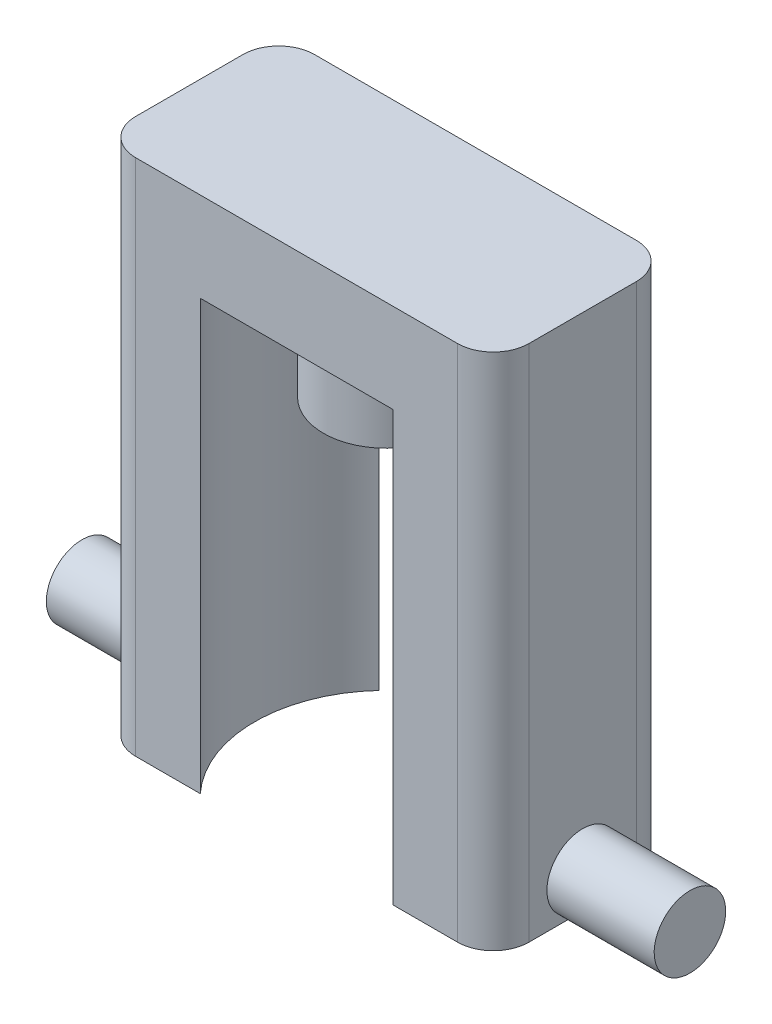
ISO-10303-21;
HEADER;
FILE_DESCRIPTION(('STEP AP214'),'2;1');
FILE_NAME('part.step','',(''),(''),'','','');
FILE_SCHEMA(('AUTOMOTIVE_DESIGN { 1 0 10303 214 1 1 1 1 }'));
ENDSEC;
DATA;
#1=APPLICATION_CONTEXT('core data for automotive mechanical design processes');
#2=APPLICATION_PROTOCOL_DEFINITION('international standard','automotive_design',2000,#1);
#3=PRODUCT_CONTEXT('',#1,'mechanical');
#4=PRODUCT('Part','Part','',(#3));
#5=PRODUCT_RELATED_PRODUCT_CATEGORY('part','',(#4));
#6=PRODUCT_DEFINITION_FORMATION('','',#4);
#7=PRODUCT_DEFINITION_CONTEXT('part definition',#1,'design');
#8=PRODUCT_DEFINITION('design','',#6,#7);
#9=PRODUCT_DEFINITION_SHAPE('','',#8);
#10=(LENGTH_UNIT() NAMED_UNIT(*) SI_UNIT(.MILLI.,.METRE.));
#11=(NAMED_UNIT(*) PLANE_ANGLE_UNIT() SI_UNIT($,.RADIAN.));
#12=(NAMED_UNIT(*) SI_UNIT($,.STERADIAN.) SOLID_ANGLE_UNIT());
#13=UNCERTAINTY_MEASURE_WITH_UNIT(LENGTH_MEASURE(1.E-05),#10,'distance_accuracy_value','');
#14=(GEOMETRIC_REPRESENTATION_CONTEXT(3) GLOBAL_UNCERTAINTY_ASSIGNED_CONTEXT((#13)) GLOBAL_UNIT_ASSIGNED_CONTEXT((#10,
#11,#12)) REPRESENTATION_CONTEXT('',''));
#15=CARTESIAN_POINT('',(0.,0.,0.));
#16=DIRECTION('',(0.,0.,1.));
#17=DIRECTION('',(1.,0.,0.));
#18=AXIS2_PLACEMENT_3D('',#15,#16,#17);
#19=CARTESIAN_POINT('',(0.,0.,0.));
#20=DIRECTION('',(0.,1.,0.));
#21=DIRECTION('',(0.,0.,1.));
#22=AXIS2_PLACEMENT_3D('',#19,#20,#21);
#23=PLANE('',#22);
#24=CARTESIAN_POINT('',(0.,0.,0.));
#25=DIRECTION('',(0.,-1.,0.));
#26=DIRECTION('',(0.,0.,-1.));
#27=AXIS2_PLACEMENT_3D('',#24,#25,#26);
#28=CIRCLE('',#27,4.445);
#29=CARTESIAN_POINT('',(0.,0.,-4.445));
#30=VERTEX_POINT('',#29);
#31=EDGE_CURVE('E197',#30,#30,#28,.T.);
#32=ORIENTED_EDGE('',*,*,#31,.F.);
#33=EDGE_LOOP('',(#32));
#34=FACE_BOUND('',#33,.T.);
#35=CARTESIAN_POINT('',(0.,0.,0.));
#36=DIRECTION('',(0.,1.,0.));
#37=DIRECTION('',(0.,0.,1.));
#38=AXIS2_PLACEMENT_3D('',#35,#36,#37);
#39=CIRCLE('',#38,9.3345);
#40=CARTESIAN_POINT('',(6.84181191279036,0.,6.34999999999999));
#41=VERTEX_POINT('',#40);
#42=CARTESIAN_POINT('',(6.84181191279036,0.,-6.35));
#43=VERTEX_POINT('',#42);
#44=EDGE_CURVE('E157',#41,#43,#39,.T.);
#45=ORIENTED_EDGE('',*,*,#44,.F.);
#46=DIRECTION('',(1.,0.,0.));
#47=VECTOR('',#46,1.);
#48=CARTESIAN_POINT('',(-13.97,0.,6.35));
#49=LINE('',#48,#47);
#50=CARTESIAN_POINT('',(-6.84181191279036,0.,6.35));
#51=VERTEX_POINT('',#50);
#52=EDGE_CURVE('E196',#51,#41,#49,.T.);
#53=ORIENTED_EDGE('',*,*,#52,.F.);
#54=CARTESIAN_POINT('',(0.,0.,0.));
#55=DIRECTION('',(0.,1.,0.));
#56=DIRECTION('',(0.,0.,-1.));
#57=AXIS2_PLACEMENT_3D('',#54,#55,#56);
#58=CIRCLE('',#57,9.3345);
#59=CARTESIAN_POINT('',(-6.84181191279035,0.,-6.35));
#60=VERTEX_POINT('',#59);
#61=EDGE_CURVE('E167',#60,#51,#58,.T.);
#62=ORIENTED_EDGE('',*,*,#61,.F.);
#63=DIRECTION('',(-1.,0.,0.));
#64=VECTOR('',#63,1.);
#65=CARTESIAN_POINT('',(-13.97,0.,-6.35));
#66=LINE('',#65,#64);
#67=EDGE_CURVE('E208',#43,#60,#66,.T.);
#68=ORIENTED_EDGE('',*,*,#67,.F.);
#69=EDGE_LOOP('',(#45,#53,#62,#68));
#70=FACE_BOUND('',#69,.T.);
#71=ADVANCED_FACE('F39',(#34,#70),#23,.F.);
#72=CARTESIAN_POINT('',(-13.97,6.35,-6.35));
#73=DIRECTION('',(1.,0.,0.));
#74=DIRECTION('',(0.,0.,-1.));
#75=AXIS2_PLACEMENT_3D('',#72,#73,#74);
#76=PLANE('',#75);
#77=DIRECTION('',(0.,0.,1.));
#78=VECTOR('',#77,1.);
#79=CARTESIAN_POINT('',(-13.97,6.35,-6.35));
#80=LINE('',#79,#78);
#81=CARTESIAN_POINT('',(-13.97,6.35,-3.81));
#82=VERTEX_POINT('',#81);
#83=CARTESIAN_POINT('',(-13.97,6.35,3.81));
#84=VERTEX_POINT('',#83);
#85=EDGE_CURVE('E203',#82,#84,#80,.T.);
#86=ORIENTED_EDGE('',*,*,#85,.F.);
#87=DIRECTION('',(0.,-1.,0.));
#88=VECTOR('',#87,1.);
#89=CARTESIAN_POINT('',(-13.97,6.35,-3.81));
#90=LINE('',#89,#88);
#91=CARTESIAN_POINT('',(-13.97,-30.48,-3.81));
#92=VERTEX_POINT('',#91);
#93=EDGE_CURVE('E226',#82,#92,#90,.T.);
#94=ORIENTED_EDGE('',*,*,#93,.T.);
#95=DIRECTION('',(0.,0.,-1.));
#96=VECTOR('',#95,1.);
#97=CARTESIAN_POINT('',(-13.97,-30.48,-6.35));
#98=LINE('',#97,#96);
#99=CARTESIAN_POINT('',(-13.97,-30.48,0.));
#100=VERTEX_POINT('',#99);
#101=EDGE_CURVE('E178',#100,#92,#98,.T.);
#102=ORIENTED_EDGE('',*,*,#101,.F.);
#103=CARTESIAN_POINT('',(-13.97,-27.94,0.));
#104=DIRECTION('',(-1.,0.,0.));
#105=DIRECTION('',(0.,0.,1.));
#106=AXIS2_PLACEMENT_3D('',#103,#104,#105);
#107=CIRCLE('',#106,2.54);
#108=EDGE_CURVE('E278',#100,#100,#107,.T.);
#109=ORIENTED_EDGE('',*,*,#108,.F.);
#110=CARTESIAN_POINT('',(-13.97,-30.48,3.81));
#111=VERTEX_POINT('',#110);
#112=EDGE_CURVE('E179',#111,#100,#98,.T.);
#113=ORIENTED_EDGE('',*,*,#112,.F.);
#114=DIRECTION('',(0.,-1.,0.));
#115=VECTOR('',#114,1.);
#116=CARTESIAN_POINT('',(-13.97,6.35,3.81));
#117=LINE('',#116,#115);
#118=EDGE_CURVE('E201',#111,#84,#117,.F.);
#119=ORIENTED_EDGE('',*,*,#118,.T.);
#120=EDGE_LOOP('',(#86,#94,#102,#109,#113,#119));
#121=FACE_BOUND('',#120,.T.);
#122=ADVANCED_FACE('F276',(#121),#76,.F.);
#123=CARTESIAN_POINT('',(-13.97,6.35,6.35));
#124=DIRECTION('',(0.,0.,-1.));
#125=DIRECTION('',(-1.,0.,0.));
#126=AXIS2_PLACEMENT_3D('',#123,#124,#125);
#127=PLANE('',#126);
#128=DIRECTION('',(1.,0.,0.));
#129=VECTOR('',#128,1.);
#130=CARTESIAN_POINT('',(-13.97,6.35,6.35));
#131=LINE('',#130,#129);
#132=CARTESIAN_POINT('',(-11.43,6.35,6.35));
#133=VERTEX_POINT('',#132);
#134=CARTESIAN_POINT('',(11.43,6.35,6.35));
#135=VERTEX_POINT('',#134);
#136=EDGE_CURVE('E207',#133,#135,#131,.T.);
#137=ORIENTED_EDGE('',*,*,#136,.F.);
#138=DIRECTION('',(0.,-1.,0.));
#139=VECTOR('',#138,1.);
#140=CARTESIAN_POINT('',(-11.43,6.35,6.35));
#141=LINE('',#140,#139);
#142=CARTESIAN_POINT('',(-11.43,-30.48,6.35));
#143=VERTEX_POINT('',#142);
#144=EDGE_CURVE('E258',#133,#143,#141,.T.);
#145=ORIENTED_EDGE('',*,*,#144,.T.);
#146=DIRECTION('',(-1.,0.,0.));
#147=VECTOR('',#146,1.);
#148=CARTESIAN_POINT('',(-13.97,-30.48,6.35));
#149=LINE('',#148,#147);
#150=CARTESIAN_POINT('',(-6.84181191279036,-30.48,6.35));
#151=VERTEX_POINT('',#150);
#152=EDGE_CURVE('E174',#151,#143,#149,.T.);
#153=ORIENTED_EDGE('',*,*,#152,.F.);
#154=DIRECTION('',(0.,1.,0.));
#155=VECTOR('',#154,1.);
#156=CARTESIAN_POINT('',(-6.84181191279036,-30.48,6.35));
#157=LINE('',#156,#155);
#158=EDGE_CURVE('E182',#151,#51,#157,.T.);
#159=ORIENTED_EDGE('',*,*,#158,.T.);
#160=ORIENTED_EDGE('',*,*,#52,.T.);
#161=DIRECTION('',(0.,1.,0.));
#162=VECTOR('',#161,1.);
#163=CARTESIAN_POINT('',(6.84181191279036,-30.48,6.34999999999999));
#164=LINE('',#163,#162);
#165=CARTESIAN_POINT('',(6.84181191279036,-30.48,6.34999999999999));
#166=VERTEX_POINT('',#165);
#167=EDGE_CURVE('E156',#166,#41,#164,.T.);
#168=ORIENTED_EDGE('',*,*,#167,.F.);
#169=DIRECTION('',(-1.,0.,0.));
#170=VECTOR('',#169,1.);
#171=CARTESIAN_POINT('',(13.97,-30.48,6.34999999999999));
#172=LINE('',#171,#170);
#173=CARTESIAN_POINT('',(11.43,-30.48,6.34999999999999));
#174=VERTEX_POINT('',#173);
#175=EDGE_CURVE('E141',#174,#166,#172,.T.);
#176=ORIENTED_EDGE('',*,*,#175,.F.);
#177=DIRECTION('',(0.,-1.,0.));
#178=VECTOR('',#177,1.);
#179=CARTESIAN_POINT('',(11.43,6.35,6.35));
#180=LINE('',#179,#178);
#181=EDGE_CURVE('E255',#174,#135,#180,.F.);
#182=ORIENTED_EDGE('',*,*,#181,.T.);
#183=EDGE_LOOP('',(#137,#145,#153,#159,#160,#168,#176,#182));
#184=FACE_BOUND('',#183,.T.);
#185=ADVANCED_FACE('F314',(#184),#127,.F.);
#186=CARTESIAN_POINT('',(13.97,6.35,-6.35));
#187=DIRECTION('',(-1.,0.,0.));
#188=DIRECTION('',(0.,0.,1.));
#189=AXIS2_PLACEMENT_3D('',#186,#187,#188);
#190=PLANE('',#189);
#191=DIRECTION('',(0.,0.,1.));
#192=VECTOR('',#191,1.);
#193=CARTESIAN_POINT('',(13.97,-30.48,-6.35000000000001));
#194=LINE('',#193,#192);
#195=CARTESIAN_POINT('',(13.97,-30.48,-3.81));
#196=VERTEX_POINT('',#195);
#197=CARTESIAN_POINT('',(13.97,-30.48,0.));
#198=VERTEX_POINT('',#197);
#199=EDGE_CURVE('E133',#196,#198,#194,.T.);
#200=ORIENTED_EDGE('',*,*,#199,.F.);
#201=DIRECTION('',(0.,-1.,0.));
#202=VECTOR('',#201,1.);
#203=CARTESIAN_POINT('',(13.97,6.35,-3.81));
#204=LINE('',#203,#202);
#205=CARTESIAN_POINT('',(13.97,6.35,-3.81));
#206=VERTEX_POINT('',#205);
#207=EDGE_CURVE('E11',#196,#206,#204,.F.);
#208=ORIENTED_EDGE('',*,*,#207,.T.);
#209=DIRECTION('',(0.,0.,-1.));
#210=VECTOR('',#209,1.);
#211=CARTESIAN_POINT('',(13.97,6.35,-6.35));
#212=LINE('',#211,#210);
#213=CARTESIAN_POINT('',(13.97,6.35,3.81));
#214=VERTEX_POINT('',#213);
#215=EDGE_CURVE('E212',#214,#206,#212,.T.);
#216=ORIENTED_EDGE('',*,*,#215,.F.);
#217=DIRECTION('',(0.,-1.,0.));
#218=VECTOR('',#217,1.);
#219=CARTESIAN_POINT('',(13.97,6.35,3.81));
#220=LINE('',#219,#218);
#221=CARTESIAN_POINT('',(13.97,-30.48,3.80999999999999));
#222=VERTEX_POINT('',#221);
#223=EDGE_CURVE('E48',#214,#222,#220,.T.);
#224=ORIENTED_EDGE('',*,*,#223,.T.);
#225=EDGE_CURVE('E136',#198,#222,#194,.T.);
#226=ORIENTED_EDGE('',*,*,#225,.F.);
#227=CARTESIAN_POINT('',(13.97,-27.94,0.));
#228=DIRECTION('',(1.,0.,0.));
#229=DIRECTION('',(0.,0.,-1.));
#230=AXIS2_PLACEMENT_3D('',#227,#228,#229);
#231=CIRCLE('',#230,2.54);
#232=EDGE_CURVE('E145',#198,#198,#231,.T.);
#233=ORIENTED_EDGE('',*,*,#232,.F.);
#234=EDGE_LOOP('',(#200,#208,#216,#224,#226,#233));
#235=FACE_BOUND('',#234,.T.);
#236=ADVANCED_FACE('F143',(#235),#190,.F.);
#237=CARTESIAN_POINT('',(-13.97,6.35,-6.35));
#238=DIRECTION('',(0.,0.,1.));
#239=DIRECTION('',(1.,0.,0.));
#240=AXIS2_PLACEMENT_3D('',#237,#238,#239);
#241=PLANE('',#240);
#242=DIRECTION('',(1.,0.,0.));
#243=VECTOR('',#242,1.);
#244=CARTESIAN_POINT('',(-6.84181191279035,-30.48,-6.35));
#245=LINE('',#244,#243);
#246=CARTESIAN_POINT('',(-11.43,-30.48,-6.35));
#247=VERTEX_POINT('',#246);
#248=CARTESIAN_POINT('',(-6.84181191279035,-30.48,-6.35));
#249=VERTEX_POINT('',#248);
#250=EDGE_CURVE('E168',#247,#249,#245,.T.);
#251=ORIENTED_EDGE('',*,*,#250,.F.);
#252=DIRECTION('',(0.,-1.,0.));
#253=VECTOR('',#252,1.);
#254=CARTESIAN_POINT('',(-11.43,6.35,-6.35));
#255=LINE('',#254,#253);
#256=CARTESIAN_POINT('',(-11.43,6.35,-6.35));
#257=VERTEX_POINT('',#256);
#258=EDGE_CURVE('E240',#247,#257,#255,.F.);
#259=ORIENTED_EDGE('',*,*,#258,.T.);
#260=DIRECTION('',(-1.,0.,0.));
#261=VECTOR('',#260,1.);
#262=CARTESIAN_POINT('',(-13.97,6.35,-6.35));
#263=LINE('',#262,#261);
#264=CARTESIAN_POINT('',(11.43,6.35,-6.35));
#265=VERTEX_POINT('',#264);
#266=EDGE_CURVE('E202',#265,#257,#263,.T.);
#267=ORIENTED_EDGE('',*,*,#266,.F.);
#268=DIRECTION('',(0.,-1.,0.));
#269=VECTOR('',#268,1.);
#270=CARTESIAN_POINT('',(11.43,6.35,-6.35));
#271=LINE('',#270,#269);
#272=CARTESIAN_POINT('',(11.43,-30.48,-6.35000000000001));
#273=VERTEX_POINT('',#272);
#274=EDGE_CURVE('E236',#265,#273,#271,.T.);
#275=ORIENTED_EDGE('',*,*,#274,.T.);
#276=DIRECTION('',(1.,0.,0.));
#277=VECTOR('',#276,1.);
#278=CARTESIAN_POINT('',(6.84181191279035,-30.48,-6.35000000000001));
#279=LINE('',#278,#277);
#280=CARTESIAN_POINT('',(6.84181191279035,-30.48,-6.35000000000001));
#281=VERTEX_POINT('',#280);
#282=EDGE_CURVE('E148',#281,#273,#279,.T.);
#283=ORIENTED_EDGE('',*,*,#282,.F.);
#284=DIRECTION('',(0.,1.,0.));
#285=VECTOR('',#284,1.);
#286=CARTESIAN_POINT('',(6.84181191279035,-30.48,-6.35000000000001));
#287=LINE('',#286,#285);
#288=EDGE_CURVE('E163',#281,#43,#287,.T.);
#289=ORIENTED_EDGE('',*,*,#288,.T.);
#290=ORIENTED_EDGE('',*,*,#67,.T.);
#291=DIRECTION('',(0.,1.,0.));
#292=VECTOR('',#291,1.);
#293=CARTESIAN_POINT('',(-6.84181191279035,-30.48,-6.35));
#294=LINE('',#293,#292);
#295=EDGE_CURVE('E188',#249,#60,#294,.T.);
#296=ORIENTED_EDGE('',*,*,#295,.F.);
#297=EDGE_LOOP('',(#251,#259,#267,#275,#283,#289,#290,#296));
#298=FACE_BOUND('',#297,.T.);
#299=ADVANCED_FACE('F286',(#298),#241,.F.);
#300=CARTESIAN_POINT('',(0.,6.35,0.));
#301=DIRECTION('',(0.,1.,0.));
#302=DIRECTION('',(0.,0.,1.));
#303=AXIS2_PLACEMENT_3D('',#300,#301,#302);
#304=PLANE('',#303);
#305=ORIENTED_EDGE('',*,*,#266,.T.);
#306=CARTESIAN_POINT('',(-11.43,6.35,-3.81));
#307=DIRECTION('',(0.,1.,0.));
#308=DIRECTION('',(0.,0.,1.));
#309=AXIS2_PLACEMENT_3D('',#306,#307,#308);
#310=CIRCLE('',#309,2.54);
#311=EDGE_CURVE('E252',#257,#82,#310,.T.);
#312=ORIENTED_EDGE('',*,*,#311,.T.);
#313=ORIENTED_EDGE('',*,*,#85,.T.);
#314=CARTESIAN_POINT('',(-11.43,6.35,3.81));
#315=DIRECTION('',(0.,1.,0.));
#316=DIRECTION('',(0.,0.,1.));
#317=AXIS2_PLACEMENT_3D('',#314,#315,#316);
#318=CIRCLE('',#317,2.54);
#319=EDGE_CURVE('E249',#84,#133,#318,.T.);
#320=ORIENTED_EDGE('',*,*,#319,.T.);
#321=ORIENTED_EDGE('',*,*,#136,.T.);
#322=CARTESIAN_POINT('',(11.43,6.35,3.81));
#323=DIRECTION('',(0.,1.,0.));
#324=DIRECTION('',(0.,0.,1.));
#325=AXIS2_PLACEMENT_3D('',#322,#323,#324);
#326=CIRCLE('',#325,2.54);
#327=EDGE_CURVE('E243',#135,#214,#326,.T.);
#328=ORIENTED_EDGE('',*,*,#327,.T.);
#329=ORIENTED_EDGE('',*,*,#215,.T.);
#330=CARTESIAN_POINT('',(11.43,6.35,-3.81));
#331=DIRECTION('',(0.,1.,0.));
#332=DIRECTION('',(0.,0.,1.));
#333=AXIS2_PLACEMENT_3D('',#330,#331,#332);
#334=CIRCLE('',#333,2.54);
#335=EDGE_CURVE('E246',#206,#265,#334,.T.);
#336=ORIENTED_EDGE('',*,*,#335,.T.);
#337=EDGE_LOOP('',(#305,#312,#313,#320,#321,#328,#329,#336));
#338=FACE_BOUND('',#337,.T.);
#339=ADVANCED_FACE('F290',(#338),#304,.T.);
#340=CARTESIAN_POINT('',(0.,-5.842,0.));
#341=DIRECTION('',(0.,1.,0.));
#342=DIRECTION('',(0.,0.,1.));
#343=AXIS2_PLACEMENT_3D('',#340,#341,#342);
#344=CYLINDRICAL_SURFACE('',#343,4.445);
#345=CARTESIAN_POINT('',(0.,-5.842,0.));
#346=DIRECTION('',(0.,-1.,0.));
#347=DIRECTION('',(0.,0.,-1.));
#348=AXIS2_PLACEMENT_3D('',#345,#346,#347);
#349=CIRCLE('',#348,4.445);
#350=CARTESIAN_POINT('',(0.,-5.842,-4.445));
#351=VERTEX_POINT('',#350);
#352=EDGE_CURVE('E192',#351,#351,#349,.T.);
#353=ORIENTED_EDGE('',*,*,#352,.F.);
#354=EDGE_LOOP('',(#353));
#355=FACE_BOUND('',#354,.T.);
#356=ORIENTED_EDGE('',*,*,#31,.T.);
#357=EDGE_LOOP('',(#356));
#358=FACE_BOUND('',#357,.T.);
#359=ADVANCED_FACE('F451',(#355,#358),#344,.T.);
#360=CARTESIAN_POINT('',(0.,-5.842,0.));
#361=DIRECTION('',(0.,-1.,0.));
#362=DIRECTION('',(0.,0.,-1.));
#363=AXIS2_PLACEMENT_3D('',#360,#361,#362);
#364=PLANE('',#363);
#365=ORIENTED_EDGE('',*,*,#352,.T.);
#366=EDGE_LOOP('',(#365));
#367=FACE_BOUND('',#366,.T.);
#368=ADVANCED_FACE('F432',(#367),#364,.T.);
#369=CARTESIAN_POINT('',(0.,-30.48,0.));
#370=DIRECTION('',(0.,1.,0.));
#371=DIRECTION('',(0.,0.,1.));
#372=AXIS2_PLACEMENT_3D('',#369,#370,#371);
#373=CYLINDRICAL_SURFACE('',#372,9.3345);
#374=ORIENTED_EDGE('',*,*,#61,.T.);
#375=ORIENTED_EDGE('',*,*,#158,.F.);
#376=CARTESIAN_POINT('',(0.,-30.48,0.));
#377=DIRECTION('',(0.,1.,0.));
#378=DIRECTION('',(0.,0.,-1.));
#379=AXIS2_PLACEMENT_3D('',#376,#377,#378);
#380=CIRCLE('',#379,9.3345);
#381=EDGE_CURVE('E171',#249,#151,#380,.T.);
#382=ORIENTED_EDGE('',*,*,#381,.F.);
#383=ORIENTED_EDGE('',*,*,#295,.T.);
#384=EDGE_LOOP('',(#374,#375,#382,#383));
#385=FACE_BOUND('',#384,.T.);
#386=ADVANCED_FACE('F309',(#385),#373,.F.);
#387=CARTESIAN_POINT('',(0.,-30.48,0.));
#388=DIRECTION('',(0.,-1.,0.));
#389=DIRECTION('',(0.,0.,-1.));
#390=AXIS2_PLACEMENT_3D('',#387,#388,#389);
#391=PLANE('',#390);
#392=ORIENTED_EDGE('',*,*,#101,.T.);
#393=CARTESIAN_POINT('',(-11.43,-30.48,-3.81));
#394=DIRECTION('',(0.,-1.,0.));
#395=DIRECTION('',(0.,0.,-1.));
#396=AXIS2_PLACEMENT_3D('',#393,#394,#395);
#397=CIRCLE('',#396,2.54);
#398=EDGE_CURVE('E233',#92,#247,#397,.T.);
#399=ORIENTED_EDGE('',*,*,#398,.T.);
#400=ORIENTED_EDGE('',*,*,#250,.T.);
#401=ORIENTED_EDGE('',*,*,#381,.T.);
#402=ORIENTED_EDGE('',*,*,#152,.T.);
#403=CARTESIAN_POINT('',(-11.43,-30.48,3.81));
#404=DIRECTION('',(0.,-1.,0.));
#405=DIRECTION('',(0.,0.,-1.));
#406=AXIS2_PLACEMENT_3D('',#403,#404,#405);
#407=CIRCLE('',#406,2.54);
#408=EDGE_CURVE('E230',#143,#111,#407,.T.);
#409=ORIENTED_EDGE('',*,*,#408,.T.);
#410=ORIENTED_EDGE('',*,*,#112,.T.);
#411=EDGE_LOOP('',(#392,#399,#400,#401,#402,#409,#410));
#412=FACE_BOUND('',#411,.T.);
#413=ADVANCED_FACE('F270',(#412),#391,.T.);
#414=CARTESIAN_POINT('',(0.,-30.48,0.));
#415=DIRECTION('',(0.,1.,0.));
#416=DIRECTION('',(0.,0.,1.));
#417=AXIS2_PLACEMENT_3D('',#414,#415,#416);
#418=CYLINDRICAL_SURFACE('',#417,9.3345);
#419=ORIENTED_EDGE('',*,*,#44,.T.);
#420=ORIENTED_EDGE('',*,*,#288,.F.);
#421=CARTESIAN_POINT('',(0.,-30.48,0.));
#422=DIRECTION('',(0.,1.,0.));
#423=DIRECTION('',(0.,0.,1.));
#424=AXIS2_PLACEMENT_3D('',#421,#422,#423);
#425=CIRCLE('',#424,9.3345);
#426=EDGE_CURVE('E150',#166,#281,#425,.T.);
#427=ORIENTED_EDGE('',*,*,#426,.F.);
#428=ORIENTED_EDGE('',*,*,#167,.T.);
#429=EDGE_LOOP('',(#419,#420,#427,#428));
#430=FACE_BOUND('',#429,.T.);
#431=ADVANCED_FACE('F301',(#430),#418,.F.);
#432=CARTESIAN_POINT('',(0.,-30.48,0.));
#433=DIRECTION('',(0.,1.,0.));
#434=DIRECTION('',(0.,0.,1.));
#435=AXIS2_PLACEMENT_3D('',#432,#433,#434);
#436=PLANE('',#435);
#437=ORIENTED_EDGE('',*,*,#282,.T.);
#438=CARTESIAN_POINT('',(11.43,-30.48,-3.81));
#439=DIRECTION('',(0.,1.,0.));
#440=DIRECTION('',(0.,0.,1.));
#441=AXIS2_PLACEMENT_3D('',#438,#439,#440);
#442=CIRCLE('',#441,2.54);
#443=EDGE_CURVE('E63',#273,#196,#442,.F.);
#444=ORIENTED_EDGE('',*,*,#443,.T.);
#445=ORIENTED_EDGE('',*,*,#199,.T.);
#446=ORIENTED_EDGE('',*,*,#225,.T.);
#447=CARTESIAN_POINT('',(11.43,-30.48,3.81));
#448=DIRECTION('',(0.,1.,0.));
#449=DIRECTION('',(0.,0.,1.));
#450=AXIS2_PLACEMENT_3D('',#447,#448,#449);
#451=CIRCLE('',#450,2.54);
#452=EDGE_CURVE('E55',#222,#174,#451,.F.);
#453=ORIENTED_EDGE('',*,*,#452,.T.);
#454=ORIENTED_EDGE('',*,*,#175,.T.);
#455=ORIENTED_EDGE('',*,*,#426,.T.);
#456=EDGE_LOOP('',(#437,#444,#445,#446,#453,#454,#455));
#457=FACE_BOUND('',#456,.T.);
#458=ADVANCED_FACE('F135',(#457),#436,.F.);
#459=CARTESIAN_POINT('',(-21.59,-27.94,0.));
#460=DIRECTION('',(1.,0.,0.));
#461=DIRECTION('',(0.,0.,-1.));
#462=AXIS2_PLACEMENT_3D('',#459,#460,#461);
#463=CYLINDRICAL_SURFACE('',#462,2.54);
#464=CARTESIAN_POINT('',(-21.59,-27.94,0.));
#465=DIRECTION('',(-1.,0.,0.));
#466=DIRECTION('',(0.,0.,1.));
#467=AXIS2_PLACEMENT_3D('',#464,#465,#466);
#468=CIRCLE('',#467,2.54);
#469=CARTESIAN_POINT('',(-21.59,-27.94,2.54));
#470=VERTEX_POINT('',#469);
#471=EDGE_CURVE('E160',#470,#470,#468,.T.);
#472=ORIENTED_EDGE('',*,*,#471,.F.);
#473=EDGE_LOOP('',(#472));
#474=FACE_BOUND('',#473,.T.);
#475=ORIENTED_EDGE('',*,*,#108,.T.);
#476=EDGE_LOOP('',(#475));
#477=FACE_BOUND('',#476,.T.);
#478=ADVANCED_FACE('F394',(#474,#477),#463,.T.);
#479=CARTESIAN_POINT('',(-21.59,-27.94,0.));
#480=DIRECTION('',(-1.,0.,0.));
#481=DIRECTION('',(0.,0.,1.));
#482=AXIS2_PLACEMENT_3D('',#479,#480,#481);
#483=PLANE('',#482);
#484=ORIENTED_EDGE('',*,*,#471,.T.);
#485=EDGE_LOOP('',(#484));
#486=FACE_BOUND('',#485,.T.);
#487=ADVANCED_FACE('F385',(#486),#483,.T.);
#488=CARTESIAN_POINT('',(21.59,-27.94,0.));
#489=DIRECTION('',(-1.,0.,0.));
#490=DIRECTION('',(0.,0.,1.));
#491=AXIS2_PLACEMENT_3D('',#488,#489,#490);
#492=CYLINDRICAL_SURFACE('',#491,2.54);
#493=CARTESIAN_POINT('',(21.59,-27.94,0.));
#494=DIRECTION('',(1.,0.,0.));
#495=DIRECTION('',(0.,0.,-1.));
#496=AXIS2_PLACEMENT_3D('',#493,#494,#495);
#497=CIRCLE('',#496,2.54);
#498=CARTESIAN_POINT('',(21.59,-27.94,-2.54));
#499=VERTEX_POINT('',#498);
#500=EDGE_CURVE('E517',#499,#499,#497,.T.);
#501=ORIENTED_EDGE('',*,*,#500,.F.);
#502=EDGE_LOOP('',(#501));
#503=FACE_BOUND('',#502,.T.);
#504=ORIENTED_EDGE('',*,*,#232,.T.);
#505=EDGE_LOOP('',(#504));
#506=FACE_BOUND('',#505,.T.);
#507=ADVANCED_FACE('F375',(#503,#506),#492,.T.);
#508=CARTESIAN_POINT('',(21.59,-27.94,0.));
#509=DIRECTION('',(1.,0.,0.));
#510=DIRECTION('',(0.,0.,-1.));
#511=AXIS2_PLACEMENT_3D('',#508,#509,#510);
#512=PLANE('',#511);
#513=ORIENTED_EDGE('',*,*,#500,.T.);
#514=EDGE_LOOP('',(#513));
#515=FACE_BOUND('',#514,.T.);
#516=ADVANCED_FACE('F344',(#515),#512,.T.);
#517=CARTESIAN_POINT('',(-11.43,6.35,-3.81));
#518=DIRECTION('',(0.,-1.,0.));
#519=DIRECTION('',(0.,0.,-1.));
#520=AXIS2_PLACEMENT_3D('',#517,#518,#519);
#521=CYLINDRICAL_SURFACE('',#520,2.54);
#522=ORIENTED_EDGE('',*,*,#311,.F.);
#523=ORIENTED_EDGE('',*,*,#258,.F.);
#524=ORIENTED_EDGE('',*,*,#398,.F.);
#525=ORIENTED_EDGE('',*,*,#93,.F.);
#526=EDGE_LOOP('',(#522,#523,#524,#525));
#527=FACE_BOUND('',#526,.T.);
#528=ADVANCED_FACE('F282',(#527),#521,.T.);
#529=CARTESIAN_POINT('',(-11.43,6.35,3.81));
#530=DIRECTION('',(0.,-1.,0.));
#531=DIRECTION('',(0.,0.,-1.));
#532=AXIS2_PLACEMENT_3D('',#529,#530,#531);
#533=CYLINDRICAL_SURFACE('',#532,2.54);
#534=ORIENTED_EDGE('',*,*,#319,.F.);
#535=ORIENTED_EDGE('',*,*,#118,.F.);
#536=ORIENTED_EDGE('',*,*,#408,.F.);
#537=ORIENTED_EDGE('',*,*,#144,.F.);
#538=EDGE_LOOP('',(#534,#535,#536,#537));
#539=FACE_BOUND('',#538,.T.);
#540=ADVANCED_FACE('F319',(#539),#533,.T.);
#541=CARTESIAN_POINT('',(11.43,6.35,-3.81));
#542=DIRECTION('',(0.,-1.,0.));
#543=DIRECTION('',(0.,0.,-1.));
#544=AXIS2_PLACEMENT_3D('',#541,#542,#543);
#545=CYLINDRICAL_SURFACE('',#544,2.54);
#546=ORIENTED_EDGE('',*,*,#335,.F.);
#547=ORIENTED_EDGE('',*,*,#207,.F.);
#548=ORIENTED_EDGE('',*,*,#443,.F.);
#549=ORIENTED_EDGE('',*,*,#274,.F.);
#550=EDGE_LOOP('',(#546,#547,#548,#549));
#551=FACE_BOUND('',#550,.T.);
#552=ADVANCED_FACE('F293',(#551),#545,.T.);
#553=CARTESIAN_POINT('',(11.43,6.35,3.81));
#554=DIRECTION('',(0.,-1.,0.));
#555=DIRECTION('',(0.,0.,-1.));
#556=AXIS2_PLACEMENT_3D('',#553,#554,#555);
#557=CYLINDRICAL_SURFACE('',#556,2.54);
#558=ORIENTED_EDGE('',*,*,#327,.F.);
#559=ORIENTED_EDGE('',*,*,#181,.F.);
#560=ORIENTED_EDGE('',*,*,#452,.F.);
#561=ORIENTED_EDGE('',*,*,#223,.F.);
#562=EDGE_LOOP('',(#558,#559,#560,#561));
#563=FACE_BOUND('',#562,.T.);
#564=ADVANCED_FACE('F41',(#563),#557,.T.);
#565=CLOSED_SHELL('',(#71,#122,#185,#236,#299,#339,#359,#368,#386,#413,#431,#458,#478,#487,#507,
#516,#528,#540,#552,#564));
#566=MANIFOLD_SOLID_BREP('B2',#565);
#567=ADVANCED_BREP_SHAPE_REPRESENTATION('',(#18,#566),#14);
#568=SHAPE_DEFINITION_REPRESENTATION(#9,#567);
ENDSEC;
END-ISO-10303-21;
